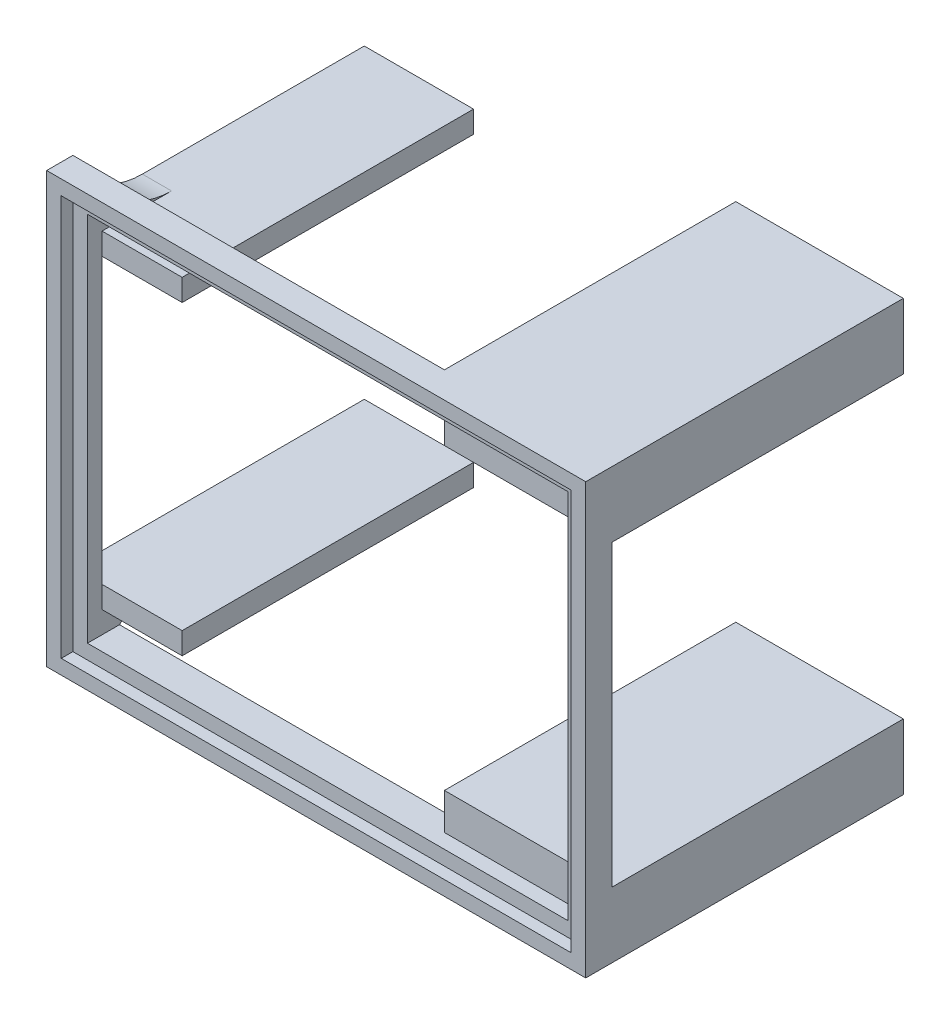
ISO-10303-21;
HEADER;
FILE_DESCRIPTION(('STEP AP214'),'2;1');
FILE_NAME('part.step','',(''),(''),'','','');
FILE_SCHEMA(('AUTOMOTIVE_DESIGN { 1 0 10303 214 1 1 1 1 }'));
ENDSEC;
DATA;
#1=APPLICATION_CONTEXT('core data for automotive mechanical design processes');
#2=APPLICATION_PROTOCOL_DEFINITION('international standard','automotive_design',2000,#1);
#3=PRODUCT_CONTEXT('',#1,'mechanical');
#4=PRODUCT('Part','Part','',(#3));
#5=PRODUCT_RELATED_PRODUCT_CATEGORY('part','',(#4));
#6=PRODUCT_DEFINITION_FORMATION('','',#4);
#7=PRODUCT_DEFINITION_CONTEXT('part definition',#1,'design');
#8=PRODUCT_DEFINITION('design','',#6,#7);
#9=PRODUCT_DEFINITION_SHAPE('','',#8);
#10=(LENGTH_UNIT() NAMED_UNIT(*) SI_UNIT(.MILLI.,.METRE.));
#11=(NAMED_UNIT(*) PLANE_ANGLE_UNIT() SI_UNIT($,.RADIAN.));
#12=(NAMED_UNIT(*) SI_UNIT($,.STERADIAN.) SOLID_ANGLE_UNIT());
#13=UNCERTAINTY_MEASURE_WITH_UNIT(LENGTH_MEASURE(1.E-05),#10,'distance_accuracy_value','');
#14=(GEOMETRIC_REPRESENTATION_CONTEXT(3) GLOBAL_UNCERTAINTY_ASSIGNED_CONTEXT((#13)) GLOBAL_UNIT_ASSIGNED_CONTEXT((#10,
#11,#12)) REPRESENTATION_CONTEXT('',''));
#15=CARTESIAN_POINT('',(0.,0.,0.));
#16=DIRECTION('',(0.,0.,1.));
#17=DIRECTION('',(1.,0.,0.));
#18=AXIS2_PLACEMENT_3D('',#15,#16,#17);
#19=CARTESIAN_POINT('',(0.,0.,0.));
#20=DIRECTION('',(0.,0.,-1.));
#21=DIRECTION('',(-1.,0.,0.));
#22=AXIS2_PLACEMENT_3D('',#19,#20,#21);
#23=PLANE('',#22);
#24=DIRECTION('',(0.,-1.,0.));
#25=VECTOR('',#24,1.);
#26=CARTESIAN_POINT('',(-33.,-25.5,0.));
#27=LINE('',#26,#25);
#28=CARTESIAN_POINT('',(-33.,19.5,0.));
#29=VERTEX_POINT('',#28);
#30=CARTESIAN_POINT('',(-33.,-19.5,0.));
#31=VERTEX_POINT('',#30);
#32=EDGE_CURVE('E471',#29,#31,#27,.T.);
#33=ORIENTED_EDGE('',*,*,#32,.T.);
#34=DIRECTION('',(1.,0.,0.));
#35=VECTOR('',#34,1.);
#36=CARTESIAN_POINT('',(-37.,-19.5,0.));
#37=LINE('',#36,#35);
#38=CARTESIAN_POINT('',(-37.,-19.5,0.));
#39=VERTEX_POINT('',#38);
#40=EDGE_CURVE('E643',#39,#31,#37,.T.);
#41=ORIENTED_EDGE('',*,*,#40,.F.);
#42=DIRECTION('',(0.,-1.,0.));
#43=VECTOR('',#42,1.);
#44=CARTESIAN_POINT('',(-37.,-29.5,0.));
#45=LINE('',#44,#43);
#46=CARTESIAN_POINT('',(-37.,19.5,0.));
#47=VERTEX_POINT('',#46);
#48=EDGE_CURVE('E446',#47,#39,#45,.T.);
#49=ORIENTED_EDGE('',*,*,#48,.F.);
#50=DIRECTION('',(-1.,0.,0.));
#51=VECTOR('',#50,1.);
#52=CARTESIAN_POINT('',(-37.,19.5,0.));
#53=LINE('',#52,#51);
#54=EDGE_CURVE('E305',#29,#47,#53,.T.);
#55=ORIENTED_EDGE('',*,*,#54,.F.);
#56=EDGE_LOOP('',(#33,#41,#49,#55));
#57=FACE_BOUND('',#56,.T.);
#58=ADVANCED_FACE('F39',(#57),#23,.T.);
#59=DIRECTION('',(0.,1.,0.));
#60=VECTOR('',#59,1.);
#61=CARTESIAN_POINT('',(37.,-29.5,0.));
#62=LINE('',#61,#60);
#63=CARTESIAN_POINT('',(37.,-20.5,0.));
#64=VERTEX_POINT('',#63);
#65=CARTESIAN_POINT('',(37.,20.5,0.));
#66=VERTEX_POINT('',#65);
#67=EDGE_CURVE('E432',#64,#66,#62,.T.);
#68=ORIENTED_EDGE('',*,*,#67,.F.);
#69=DIRECTION('',(1.,0.,0.));
#70=VECTOR('',#69,1.);
#71=CARTESIAN_POINT('',(37.,-20.5,0.));
#72=LINE('',#71,#70);
#73=CARTESIAN_POINT('',(33.,-20.5,0.));
#74=VERTEX_POINT('',#73);
#75=EDGE_CURVE('E345',#74,#64,#72,.T.);
#76=ORIENTED_EDGE('',*,*,#75,.F.);
#77=DIRECTION('',(0.,1.,0.));
#78=VECTOR('',#77,1.);
#79=CARTESIAN_POINT('',(33.,-25.5,0.));
#80=LINE('',#79,#78);
#81=CARTESIAN_POINT('',(33.,20.5,0.));
#82=VERTEX_POINT('',#81);
#83=EDGE_CURVE('E486',#74,#82,#80,.T.);
#84=ORIENTED_EDGE('',*,*,#83,.T.);
#85=DIRECTION('',(-1.,0.,0.));
#86=VECTOR('',#85,1.);
#87=CARTESIAN_POINT('',(37.,20.5,0.));
#88=LINE('',#87,#86);
#89=EDGE_CURVE('E379',#66,#82,#88,.T.);
#90=ORIENTED_EDGE('',*,*,#89,.F.);
#91=EDGE_LOOP('',(#68,#76,#84,#90));
#92=FACE_BOUND('',#91,.T.);
#93=ADVANCED_FACE('F684',(#92),#23,.T.);
#94=CARTESIAN_POINT('',(0.,0.,2.));
#95=DIRECTION('',(0.,0.,-1.));
#96=DIRECTION('',(-1.,0.,0.));
#97=AXIS2_PLACEMENT_3D('',#94,#95,#96);
#98=PLANE('',#97);
#99=DIRECTION('',(0.,1.,0.));
#100=VECTOR('',#99,1.);
#101=CARTESIAN_POINT('',(35.,-27.5,2.));
#102=LINE('',#101,#100);
#103=CARTESIAN_POINT('',(35.,-27.5,2.));
#104=VERTEX_POINT('',#103);
#105=CARTESIAN_POINT('',(35.,27.5,2.));
#106=VERTEX_POINT('',#105);
#107=EDGE_CURVE('E505',#104,#106,#102,.T.);
#108=ORIENTED_EDGE('',*,*,#107,.T.);
#109=DIRECTION('',(-1.,0.,0.));
#110=VECTOR('',#109,1.);
#111=CARTESIAN_POINT('',(-35.,27.5,2.));
#112=LINE('',#111,#110);
#113=CARTESIAN_POINT('',(-35.,27.5,2.));
#114=VERTEX_POINT('',#113);
#115=EDGE_CURVE('E509',#106,#114,#112,.T.);
#116=ORIENTED_EDGE('',*,*,#115,.T.);
#117=DIRECTION('',(0.,-1.,0.));
#118=VECTOR('',#117,1.);
#119=CARTESIAN_POINT('',(-35.,-27.5,2.));
#120=LINE('',#119,#118);
#121=CARTESIAN_POINT('',(-35.,-27.5,2.));
#122=VERTEX_POINT('',#121);
#123=EDGE_CURVE('E513',#114,#122,#120,.T.);
#124=ORIENTED_EDGE('',*,*,#123,.T.);
#125=DIRECTION('',(1.,0.,0.));
#126=VECTOR('',#125,1.);
#127=CARTESIAN_POINT('',(-35.,-27.5,2.));
#128=LINE('',#127,#126);
#129=EDGE_CURVE('E517',#122,#104,#128,.T.);
#130=ORIENTED_EDGE('',*,*,#129,.T.);
#131=EDGE_LOOP('',(#108,#116,#124,#130));
#132=FACE_BOUND('',#131,.T.);
#133=DIRECTION('',(0.,1.,0.));
#134=VECTOR('',#133,1.);
#135=CARTESIAN_POINT('',(33.,-25.5,2.));
#136=LINE('',#135,#134);
#137=CARTESIAN_POINT('',(33.,-25.5,2.));
#138=VERTEX_POINT('',#137);
#139=CARTESIAN_POINT('',(33.,25.5,2.));
#140=VERTEX_POINT('',#139);
#141=EDGE_CURVE('E467',#138,#140,#136,.T.);
#142=ORIENTED_EDGE('',*,*,#141,.F.);
#143=DIRECTION('',(1.,0.,0.));
#144=VECTOR('',#143,1.);
#145=CARTESIAN_POINT('',(-33.,-25.5,2.));
#146=LINE('',#145,#144);
#147=CARTESIAN_POINT('',(-33.,-25.5,2.));
#148=VERTEX_POINT('',#147);
#149=EDGE_CURVE('E478',#148,#138,#146,.T.);
#150=ORIENTED_EDGE('',*,*,#149,.F.);
#151=DIRECTION('',(0.,-1.,0.));
#152=VECTOR('',#151,1.);
#153=CARTESIAN_POINT('',(-33.,-25.5,2.));
#154=LINE('',#153,#152);
#155=CARTESIAN_POINT('',(-33.,25.5,2.));
#156=VERTEX_POINT('',#155);
#157=EDGE_CURVE('E474',#156,#148,#154,.T.);
#158=ORIENTED_EDGE('',*,*,#157,.F.);
#159=DIRECTION('',(-1.,0.,0.));
#160=VECTOR('',#159,1.);
#161=CARTESIAN_POINT('',(-33.,25.5,2.));
#162=LINE('',#161,#160);
#163=EDGE_CURVE('E470',#140,#156,#162,.T.);
#164=ORIENTED_EDGE('',*,*,#163,.F.);
#165=EDGE_LOOP('',(#142,#150,#158,#164));
#166=FACE_BOUND('',#165,.T.);
#167=ADVANCED_FACE('F617',(#132,#166),#98,.F.);
#168=CARTESIAN_POINT('',(33.,-25.5,2.));
#169=DIRECTION('',(-1.,0.,0.));
#170=DIRECTION('',(0.,0.,1.));
#171=AXIS2_PLACEMENT_3D('',#168,#169,#170);
#172=PLANE('',#171);
#173=CARTESIAN_POINT('',(33.,-25.5,0.));
#174=VERTEX_POINT('',#173);
#175=EDGE_CURVE('E482',#174,#74,#80,.T.);
#176=ORIENTED_EDGE('',*,*,#175,.F.);
#177=DIRECTION('',(0.,0.,-1.));
#178=VECTOR('',#177,1.);
#179=CARTESIAN_POINT('',(33.,-25.5,2.));
#180=LINE('',#179,#178);
#181=EDGE_CURVE('E481',#138,#174,#180,.T.);
#182=ORIENTED_EDGE('',*,*,#181,.F.);
#183=ORIENTED_EDGE('',*,*,#141,.T.);
#184=DIRECTION('',(0.,0.,-1.));
#185=VECTOR('',#184,1.);
#186=CARTESIAN_POINT('',(33.,25.5,2.));
#187=LINE('',#186,#185);
#188=CARTESIAN_POINT('',(33.,25.5,0.));
#189=VERTEX_POINT('',#188);
#190=EDGE_CURVE('E501',#140,#189,#187,.T.);
#191=ORIENTED_EDGE('',*,*,#190,.T.);
#192=EDGE_CURVE('E458',#82,#189,#80,.T.);
#193=ORIENTED_EDGE('',*,*,#192,.F.);
#194=ORIENTED_EDGE('',*,*,#83,.F.);
#195=EDGE_LOOP('',(#176,#182,#183,#191,#193,#194));
#196=FACE_BOUND('',#195,.T.);
#197=ADVANCED_FACE('F611',(#196),#172,.T.);
#198=CARTESIAN_POINT('',(-33.,25.5,2.));
#199=DIRECTION('',(0.,-1.,0.));
#200=DIRECTION('',(0.,0.,-1.));
#201=AXIS2_PLACEMENT_3D('',#198,#199,#200);
#202=PLANE('',#201);
#203=DIRECTION('',(-1.,0.,0.));
#204=VECTOR('',#203,1.);
#205=CARTESIAN_POINT('',(-33.,25.5,0.));
#206=LINE('',#205,#204);
#207=CARTESIAN_POINT('',(14.,25.5,0.));
#208=VERTEX_POINT('',#207);
#209=EDGE_CURVE('E485',#189,#208,#206,.T.);
#210=ORIENTED_EDGE('',*,*,#209,.F.);
#211=ORIENTED_EDGE('',*,*,#190,.F.);
#212=ORIENTED_EDGE('',*,*,#163,.T.);
#213=DIRECTION('',(0.,0.,-1.));
#214=VECTOR('',#213,1.);
#215=CARTESIAN_POINT('',(-33.,25.5,2.));
#216=LINE('',#215,#214);
#217=CARTESIAN_POINT('',(-33.,25.5,-2.3979635856266));
#218=VERTEX_POINT('',#217);
#219=EDGE_CURVE('E61',#156,#218,#216,.T.);
#220=ORIENTED_EDGE('',*,*,#219,.T.);
#221=DIRECTION('',(1.,0.,0.));
#222=VECTOR('',#221,1.);
#223=CARTESIAN_POINT('',(-33.,25.5,-2.3979635856266));
#224=LINE('',#223,#222);
#225=CARTESIAN_POINT('',(14.,25.5,-2.3979635856266));
#226=VERTEX_POINT('',#225);
#227=EDGE_CURVE('E48',#218,#226,#224,.T.);
#228=ORIENTED_EDGE('',*,*,#227,.T.);
#229=DIRECTION('',(0.,0.,-1.));
#230=VECTOR('',#229,1.);
#231=CARTESIAN_POINT('',(14.,25.5,-40.));
#232=LINE('',#231,#230);
#233=EDGE_CURVE('E55',#208,#226,#232,.T.);
#234=ORIENTED_EDGE('',*,*,#233,.F.);
#235=EDGE_LOOP('',(#210,#211,#212,#220,#228,#234));
#236=FACE_BOUND('',#235,.T.);
#237=ADVANCED_FACE('F562',(#236),#202,.T.);
#238=CARTESIAN_POINT('',(-33.,-25.5,2.));
#239=DIRECTION('',(1.,0.,0.));
#240=DIRECTION('',(0.,0.,-1.));
#241=AXIS2_PLACEMENT_3D('',#238,#239,#240);
#242=PLANE('',#241);
#243=DIRECTION('',(0.,1.,0.));
#244=VECTOR('',#243,1.);
#245=CARTESIAN_POINT('',(-33.,-25.5,0.));
#246=LINE('',#245,#244);
#247=CARTESIAN_POINT('',(-33.,22.5,0.));
#248=VERTEX_POINT('',#247);
#249=EDGE_CURVE('E323',#29,#248,#246,.T.);
#250=ORIENTED_EDGE('',*,*,#249,.T.);
#251=DIRECTION('',(0.,0.,1.));
#252=VECTOR('',#251,1.);
#253=CARTESIAN_POINT('',(-33.,22.5,-40.));
#254=LINE('',#253,#252);
#255=CARTESIAN_POINT('',(-33.,22.5,-9.53939201416946));
#256=VERTEX_POINT('',#255);
#257=EDGE_CURVE('E536',#256,#248,#254,.T.);
#258=ORIENTED_EDGE('',*,*,#257,.F.);
#259=CARTESIAN_POINT('',(-33.,32.5,-9.53939201416946));
#260=DIRECTION('',(1.,0.,0.));
#261=DIRECTION('',(0.,0.,-1.));
#262=AXIS2_PLACEMENT_3D('',#259,#260,#261);
#263=CIRCLE('',#262,10.);
#264=EDGE_CURVE('E558',#256,#218,#263,.F.);
#265=ORIENTED_EDGE('',*,*,#264,.T.);
#266=ORIENTED_EDGE('',*,*,#219,.F.);
#267=ORIENTED_EDGE('',*,*,#157,.T.);
#268=DIRECTION('',(0.,0.,-1.));
#269=VECTOR('',#268,1.);
#270=CARTESIAN_POINT('',(-33.,-25.5,2.));
#271=LINE('',#270,#269);
#272=CARTESIAN_POINT('',(-33.,-25.5,-2.3979635856266));
#273=VERTEX_POINT('',#272);
#274=EDGE_CURVE('E496',#148,#273,#271,.T.);
#275=ORIENTED_EDGE('',*,*,#274,.T.);
#276=CARTESIAN_POINT('',(-33.,-32.5,-9.53939201416946));
#277=DIRECTION('',(1.,0.,0.));
#278=DIRECTION('',(0.,0.,-1.));
#279=AXIS2_PLACEMENT_3D('',#276,#277,#278);
#280=CIRCLE('',#279,10.);
#281=CARTESIAN_POINT('',(-33.,-22.5,-9.53939201416946));
#282=VERTEX_POINT('',#281);
#283=EDGE_CURVE('E555',#273,#282,#280,.F.);
#284=ORIENTED_EDGE('',*,*,#283,.T.);
#285=DIRECTION('',(0.,0.,-1.));
#286=VECTOR('',#285,1.);
#287=CARTESIAN_POINT('',(-33.,-22.5,-40.));
#288=LINE('',#287,#286);
#289=CARTESIAN_POINT('',(-33.,-22.5,0.));
#290=VERTEX_POINT('',#289);
#291=EDGE_CURVE('E521',#290,#282,#288,.T.);
#292=ORIENTED_EDGE('',*,*,#291,.F.);
#293=DIRECTION('',(0.,1.,0.));
#294=VECTOR('',#293,1.);
#295=CARTESIAN_POINT('',(-33.,-25.5,0.));
#296=LINE('',#295,#294);
#297=EDGE_CURVE('E274',#290,#31,#296,.T.);
#298=ORIENTED_EDGE('',*,*,#297,.T.);
#299=ORIENTED_EDGE('',*,*,#32,.F.);
#300=EDGE_LOOP('',(#250,#258,#265,#266,#267,#275,#284,#292,#298,#299));
#301=FACE_BOUND('',#300,.T.);
#302=ADVANCED_FACE('F620',(#301),#242,.T.);
#303=CARTESIAN_POINT('',(-33.,-25.5,2.));
#304=DIRECTION('',(0.,1.,0.));
#305=DIRECTION('',(0.,0.,1.));
#306=AXIS2_PLACEMENT_3D('',#303,#304,#305);
#307=PLANE('',#306);
#308=DIRECTION('',(1.,0.,0.));
#309=VECTOR('',#308,1.);
#310=CARTESIAN_POINT('',(-33.,-25.5,0.));
#311=LINE('',#310,#309);
#312=CARTESIAN_POINT('',(14.,-25.5,0.));
#313=VERTEX_POINT('',#312);
#314=EDGE_CURVE('E359',#313,#174,#311,.T.);
#315=ORIENTED_EDGE('',*,*,#314,.F.);
#316=DIRECTION('',(0.,0.,1.));
#317=VECTOR('',#316,1.);
#318=CARTESIAN_POINT('',(14.,-25.5,-40.));
#319=LINE('',#318,#317);
#320=CARTESIAN_POINT('',(14.,-25.5,-2.3979635856266));
#321=VERTEX_POINT('',#320);
#322=EDGE_CURVE('E533',#321,#313,#319,.T.);
#323=ORIENTED_EDGE('',*,*,#322,.F.);
#324=DIRECTION('',(-1.,0.,0.));
#325=VECTOR('',#324,1.);
#326=CARTESIAN_POINT('',(14.,-25.5,-2.3979635856266));
#327=LINE('',#326,#325);
#328=EDGE_CURVE('E551',#321,#273,#327,.T.);
#329=ORIENTED_EDGE('',*,*,#328,.T.);
#330=ORIENTED_EDGE('',*,*,#274,.F.);
#331=ORIENTED_EDGE('',*,*,#149,.T.);
#332=ORIENTED_EDGE('',*,*,#181,.T.);
#333=EDGE_LOOP('',(#315,#323,#329,#330,#331,#332));
#334=FACE_BOUND('',#333,.T.);
#335=ADVANCED_FACE('F827',(#334),#307,.T.);
#336=CARTESIAN_POINT('',(35.,27.5,0.));
#337=DIRECTION('',(0.,1.,0.));
#338=DIRECTION('',(0.,0.,1.));
#339=AXIS2_PLACEMENT_3D('',#336,#337,#338);
#340=PLANE('',#339);
#341=DIRECTION('',(0.,0.,1.));
#342=VECTOR('',#341,1.);
#343=CARTESIAN_POINT('',(-35.,27.5,0.));
#344=LINE('',#343,#342);
#345=CARTESIAN_POINT('',(-35.,27.5,3.6));
#346=VERTEX_POINT('',#345);
#347=EDGE_CURVE('E428',#114,#346,#344,.T.);
#348=ORIENTED_EDGE('',*,*,#347,.F.);
#349=ORIENTED_EDGE('',*,*,#115,.F.);
#350=DIRECTION('',(0.,0.,1.));
#351=VECTOR('',#350,1.);
#352=CARTESIAN_POINT('',(35.,27.5,0.));
#353=LINE('',#352,#351);
#354=CARTESIAN_POINT('',(35.,27.5,3.6));
#355=VERTEX_POINT('',#354);
#356=EDGE_CURVE('E429',#106,#355,#353,.T.);
#357=ORIENTED_EDGE('',*,*,#356,.T.);
#358=DIRECTION('',(-1.,0.,0.));
#359=VECTOR('',#358,1.);
#360=CARTESIAN_POINT('',(35.,27.5,3.6));
#361=LINE('',#360,#359);
#362=EDGE_CURVE('E396',#355,#346,#361,.T.);
#363=ORIENTED_EDGE('',*,*,#362,.T.);
#364=EDGE_LOOP('',(#348,#349,#357,#363));
#365=FACE_BOUND('',#364,.T.);
#366=ADVANCED_FACE('F836',(#365),#340,.F.);
#367=CARTESIAN_POINT('',(-35.,-27.5,0.));
#368=DIRECTION('',(0.,-1.,0.));
#369=DIRECTION('',(0.,0.,-1.));
#370=AXIS2_PLACEMENT_3D('',#367,#368,#369);
#371=PLANE('',#370);
#372=DIRECTION('',(0.,0.,1.));
#373=VECTOR('',#372,1.);
#374=CARTESIAN_POINT('',(35.,-27.5,0.));
#375=LINE('',#374,#373);
#376=CARTESIAN_POINT('',(35.,-27.5,3.6));
#377=VERTEX_POINT('',#376);
#378=EDGE_CURVE('E433',#104,#377,#375,.T.);
#379=ORIENTED_EDGE('',*,*,#378,.F.);
#380=ORIENTED_EDGE('',*,*,#129,.F.);
#381=DIRECTION('',(0.,0.,1.));
#382=VECTOR('',#381,1.);
#383=CARTESIAN_POINT('',(-35.,-27.5,0.));
#384=LINE('',#383,#382);
#385=CARTESIAN_POINT('',(-35.,-27.5,3.6));
#386=VERTEX_POINT('',#385);
#387=EDGE_CURVE('E436',#122,#386,#384,.T.);
#388=ORIENTED_EDGE('',*,*,#387,.T.);
#389=DIRECTION('',(1.,0.,0.));
#390=VECTOR('',#389,1.);
#391=CARTESIAN_POINT('',(-35.,-27.5,3.6));
#392=LINE('',#391,#390);
#393=EDGE_CURVE('E404',#386,#377,#392,.T.);
#394=ORIENTED_EDGE('',*,*,#393,.T.);
#395=EDGE_LOOP('',(#379,#380,#388,#394));
#396=FACE_BOUND('',#395,.T.);
#397=ADVANCED_FACE('F962',(#396),#371,.F.);
#398=CARTESIAN_POINT('',(35.,-27.5,0.));
#399=DIRECTION('',(1.,0.,0.));
#400=DIRECTION('',(0.,0.,-1.));
#401=AXIS2_PLACEMENT_3D('',#398,#399,#400);
#402=PLANE('',#401);
#403=ORIENTED_EDGE('',*,*,#356,.F.);
#404=ORIENTED_EDGE('',*,*,#107,.F.);
#405=ORIENTED_EDGE('',*,*,#378,.T.);
#406=DIRECTION('',(0.,1.,0.));
#407=VECTOR('',#406,1.);
#408=CARTESIAN_POINT('',(35.,-27.5,3.6));
#409=LINE('',#408,#407);
#410=EDGE_CURVE('E408',#377,#355,#409,.T.);
#411=ORIENTED_EDGE('',*,*,#410,.T.);
#412=EDGE_LOOP('',(#403,#404,#405,#411));
#413=FACE_BOUND('',#412,.T.);
#414=ADVANCED_FACE('F951',(#413),#402,.F.);
#415=CARTESIAN_POINT('',(-35.,27.5,0.));
#416=DIRECTION('',(-1.,0.,0.));
#417=DIRECTION('',(0.,0.,1.));
#418=AXIS2_PLACEMENT_3D('',#415,#416,#417);
#419=PLANE('',#418);
#420=ORIENTED_EDGE('',*,*,#387,.F.);
#421=ORIENTED_EDGE('',*,*,#123,.F.);
#422=ORIENTED_EDGE('',*,*,#347,.T.);
#423=DIRECTION('',(0.,-1.,0.));
#424=VECTOR('',#423,1.);
#425=CARTESIAN_POINT('',(-35.,27.5,3.6));
#426=LINE('',#425,#424);
#427=EDGE_CURVE('E400',#346,#386,#426,.T.);
#428=ORIENTED_EDGE('',*,*,#427,.T.);
#429=EDGE_LOOP('',(#420,#421,#422,#428));
#430=FACE_BOUND('',#429,.T.);
#431=ADVANCED_FACE('F916',(#430),#419,.F.);
#432=CARTESIAN_POINT('',(37.,-29.5,0.));
#433=DIRECTION('',(1.,0.,0.));
#434=DIRECTION('',(0.,0.,-1.));
#435=AXIS2_PLACEMENT_3D('',#432,#433,#434);
#436=PLANE('',#435);
#437=DIRECTION('',(0.,0.,1.));
#438=VECTOR('',#437,1.);
#439=CARTESIAN_POINT('',(37.,29.5,0.));
#440=LINE('',#439,#438);
#441=CARTESIAN_POINT('',(37.,29.5,-40.));
#442=VERTEX_POINT('',#441);
#443=CARTESIAN_POINT('',(37.,29.5,3.6));
#444=VERTEX_POINT('',#443);
#445=EDGE_CURVE('E454',#442,#444,#440,.T.);
#446=ORIENTED_EDGE('',*,*,#445,.T.);
#447=DIRECTION('',(0.,1.,0.));
#448=VECTOR('',#447,1.);
#449=CARTESIAN_POINT('',(37.,-29.5,3.6));
#450=LINE('',#449,#448);
#451=CARTESIAN_POINT('',(37.,-29.5,3.6));
#452=VERTEX_POINT('',#451);
#453=EDGE_CURVE('E412',#452,#444,#450,.T.);
#454=ORIENTED_EDGE('',*,*,#453,.F.);
#455=DIRECTION('',(0.,0.,1.));
#456=VECTOR('',#455,1.);
#457=CARTESIAN_POINT('',(37.,-29.5,0.));
#458=LINE('',#457,#456);
#459=CARTESIAN_POINT('',(37.,-29.5,-40.));
#460=VERTEX_POINT('',#459);
#461=EDGE_CURVE('E455',#460,#452,#458,.T.);
#462=ORIENTED_EDGE('',*,*,#461,.F.);
#463=DIRECTION('',(0.,-1.,0.));
#464=VECTOR('',#463,1.);
#465=CARTESIAN_POINT('',(37.,-29.5,-40.));
#466=LINE('',#465,#464);
#467=CARTESIAN_POINT('',(37.,-20.5,-40.));
#468=VERTEX_POINT('',#467);
#469=EDGE_CURVE('E328',#468,#460,#466,.T.);
#470=ORIENTED_EDGE('',*,*,#469,.F.);
#471=DIRECTION('',(0.,0.,1.));
#472=VECTOR('',#471,1.);
#473=CARTESIAN_POINT('',(37.,-20.5,-40.));
#474=LINE('',#473,#472);
#475=EDGE_CURVE('E342',#468,#64,#474,.T.);
#476=ORIENTED_EDGE('',*,*,#475,.T.);
#477=ORIENTED_EDGE('',*,*,#67,.T.);
#478=DIRECTION('',(0.,0.,1.));
#479=VECTOR('',#478,1.);
#480=CARTESIAN_POINT('',(37.,20.5,-40.));
#481=LINE('',#480,#479);
#482=CARTESIAN_POINT('',(37.,20.5,-40.));
#483=VERTEX_POINT('',#482);
#484=EDGE_CURVE('E392',#483,#66,#481,.T.);
#485=ORIENTED_EDGE('',*,*,#484,.F.);
#486=DIRECTION('',(0.,-1.,0.));
#487=VECTOR('',#486,1.);
#488=CARTESIAN_POINT('',(37.,29.5,-40.));
#489=LINE('',#488,#487);
#490=EDGE_CURVE('E363',#442,#483,#489,.T.);
#491=ORIENTED_EDGE('',*,*,#490,.F.);
#492=EDGE_LOOP('',(#446,#454,#462,#470,#476,#477,#485,#491));
#493=FACE_BOUND('',#492,.T.);
#494=ADVANCED_FACE('F594',(#493),#436,.T.);
#495=CARTESIAN_POINT('',(-37.,-29.5,0.));
#496=DIRECTION('',(0.,-1.,0.));
#497=DIRECTION('',(0.,0.,-1.));
#498=AXIS2_PLACEMENT_3D('',#495,#496,#497);
#499=PLANE('',#498);
#500=ORIENTED_EDGE('',*,*,#461,.T.);
#501=DIRECTION('',(1.,0.,0.));
#502=VECTOR('',#501,1.);
#503=CARTESIAN_POINT('',(-37.,-29.5,3.6));
#504=LINE('',#503,#502);
#505=CARTESIAN_POINT('',(-37.,-29.5,3.6));
#506=VERTEX_POINT('',#505);
#507=EDGE_CURVE('E424',#506,#452,#504,.T.);
#508=ORIENTED_EDGE('',*,*,#507,.F.);
#509=DIRECTION('',(0.,0.,1.));
#510=VECTOR('',#509,1.);
#511=CARTESIAN_POINT('',(-37.,-29.5,0.));
#512=LINE('',#511,#510);
#513=CARTESIAN_POINT('',(-37.,-29.5,0.));
#514=VERTEX_POINT('',#513);
#515=EDGE_CURVE('E459',#514,#506,#512,.T.);
#516=ORIENTED_EDGE('',*,*,#515,.F.);
#517=DIRECTION('',(1.,0.,0.));
#518=VECTOR('',#517,1.);
#519=CARTESIAN_POINT('',(-37.,-29.5,0.));
#520=LINE('',#519,#518);
#521=CARTESIAN_POINT('',(14.,-29.5,0.));
#522=VERTEX_POINT('',#521);
#523=EDGE_CURVE('E450',#514,#522,#520,.T.);
#524=ORIENTED_EDGE('',*,*,#523,.T.);
#525=DIRECTION('',(0.,0.,1.));
#526=VECTOR('',#525,1.);
#527=CARTESIAN_POINT('',(14.,-29.5,-40.));
#528=LINE('',#527,#526);
#529=CARTESIAN_POINT('',(14.,-29.5,-40.));
#530=VERTEX_POINT('',#529);
#531=EDGE_CURVE('E356',#530,#522,#528,.T.);
#532=ORIENTED_EDGE('',*,*,#531,.F.);
#533=DIRECTION('',(-1.,0.,0.));
#534=VECTOR('',#533,1.);
#535=CARTESIAN_POINT('',(37.,-29.5,-40.));
#536=LINE('',#535,#534);
#537=EDGE_CURVE('E332',#460,#530,#536,.T.);
#538=ORIENTED_EDGE('',*,*,#537,.F.);
#539=EDGE_LOOP('',(#500,#508,#516,#524,#532,#538));
#540=FACE_BOUND('',#539,.T.);
#541=ADVANCED_FACE('F588',(#540),#499,.T.);
#542=CARTESIAN_POINT('',(-37.,-29.5,0.));
#543=DIRECTION('',(-1.,0.,0.));
#544=DIRECTION('',(0.,0.,1.));
#545=AXIS2_PLACEMENT_3D('',#542,#543,#544);
#546=PLANE('',#545);
#547=ORIENTED_EDGE('',*,*,#515,.T.);
#548=DIRECTION('',(0.,-1.,0.));
#549=VECTOR('',#548,1.);
#550=CARTESIAN_POINT('',(-37.,-29.5,3.6));
#551=LINE('',#550,#549);
#552=CARTESIAN_POINT('',(-37.,29.5,3.6));
#553=VERTEX_POINT('',#552);
#554=EDGE_CURVE('E420',#553,#506,#551,.T.);
#555=ORIENTED_EDGE('',*,*,#554,.F.);
#556=DIRECTION('',(0.,0.,1.));
#557=VECTOR('',#556,1.);
#558=CARTESIAN_POINT('',(-37.,29.5,0.));
#559=LINE('',#558,#557);
#560=CARTESIAN_POINT('',(-37.,29.5,0.));
#561=VERTEX_POINT('',#560);
#562=EDGE_CURVE('E462',#561,#553,#559,.T.);
#563=ORIENTED_EDGE('',*,*,#562,.F.);
#564=CARTESIAN_POINT('',(-37.,32.5,-9.53939201416946));
#565=DIRECTION('',(-1.,0.,0.));
#566=DIRECTION('',(0.,0.,1.));
#567=AXIS2_PLACEMENT_3D('',#564,#565,#566);
#568=CIRCLE('',#567,10.);
#569=CARTESIAN_POINT('',(-37.,22.5,-9.53939201416946));
#570=VERTEX_POINT('',#569);
#571=EDGE_CURVE('E11',#561,#570,#568,.F.);
#572=ORIENTED_EDGE('',*,*,#571,.T.);
#573=DIRECTION('',(0.,0.,1.));
#574=VECTOR('',#573,1.);
#575=CARTESIAN_POINT('',(-37.,22.5,-40.));
#576=LINE('',#575,#574);
#577=CARTESIAN_POINT('',(-37.,22.5,-40.));
#578=VERTEX_POINT('',#577);
#579=EDGE_CURVE('E319',#578,#570,#576,.T.);
#580=ORIENTED_EDGE('',*,*,#579,.F.);
#581=DIRECTION('',(0.,1.,0.));
#582=VECTOR('',#581,1.);
#583=CARTESIAN_POINT('',(-37.,19.5,-40.));
#584=LINE('',#583,#582);
#585=CARTESIAN_POINT('',(-37.,19.5,-40.));
#586=VERTEX_POINT('',#585);
#587=EDGE_CURVE('E285',#586,#578,#584,.T.);
#588=ORIENTED_EDGE('',*,*,#587,.F.);
#589=DIRECTION('',(0.,0.,1.));
#590=VECTOR('',#589,1.);
#591=CARTESIAN_POINT('',(-37.,19.5,-40.));
#592=LINE('',#591,#590);
#593=EDGE_CURVE('E299',#586,#47,#592,.T.);
#594=ORIENTED_EDGE('',*,*,#593,.T.);
#595=ORIENTED_EDGE('',*,*,#48,.T.);
#596=DIRECTION('',(0.,0.,1.));
#597=VECTOR('',#596,1.);
#598=CARTESIAN_POINT('',(-37.,-19.5,-40.));
#599=LINE('',#598,#597);
#600=CARTESIAN_POINT('',(-37.,-19.5,-40.));
#601=VERTEX_POINT('',#600);
#602=EDGE_CURVE('E644',#601,#39,#599,.T.);
#603=ORIENTED_EDGE('',*,*,#602,.F.);
#604=DIRECTION('',(0.,1.,0.));
#605=VECTOR('',#604,1.);
#606=CARTESIAN_POINT('',(-37.,-19.5,-40.));
#607=LINE('',#606,#605);
#608=CARTESIAN_POINT('',(-37.,-22.5,-40.));
#609=VERTEX_POINT('',#608);
#610=EDGE_CURVE('E263',#609,#601,#607,.T.);
#611=ORIENTED_EDGE('',*,*,#610,.F.);
#612=DIRECTION('',(0.,0.,1.));
#613=VECTOR('',#612,1.);
#614=CARTESIAN_POINT('',(-37.,-22.5,-40.));
#615=LINE('',#614,#613);
#616=CARTESIAN_POINT('',(-37.,-22.5,-9.53939201416946));
#617=VERTEX_POINT('',#616);
#618=EDGE_CURVE('E281',#609,#617,#615,.T.);
#619=ORIENTED_EDGE('',*,*,#618,.T.);
#620=CARTESIAN_POINT('',(-37.,-32.5,-9.53939201416946));
#621=DIRECTION('',(-1.,0.,0.));
#622=DIRECTION('',(0.,0.,1.));
#623=AXIS2_PLACEMENT_3D('',#620,#621,#622);
#624=CIRCLE('',#623,10.);
#625=EDGE_CURVE('E548',#617,#514,#624,.F.);
#626=ORIENTED_EDGE('',*,*,#625,.T.);
#627=EDGE_LOOP('',(#547,#555,#563,#572,#580,#588,#594,#595,#603,#611,#619,#626));
#628=FACE_BOUND('',#627,.T.);
#629=ADVANCED_FACE('F579',(#628),#546,.T.);
#630=CARTESIAN_POINT('',(-37.,29.5,0.));
#631=DIRECTION('',(0.,1.,0.));
#632=DIRECTION('',(0.,0.,1.));
#633=AXIS2_PLACEMENT_3D('',#630,#631,#632);
#634=PLANE('',#633);
#635=ORIENTED_EDGE('',*,*,#562,.T.);
#636=DIRECTION('',(-1.,0.,0.));
#637=VECTOR('',#636,1.);
#638=CARTESIAN_POINT('',(-37.,29.5,3.6));
#639=LINE('',#638,#637);
#640=EDGE_CURVE('E416',#444,#553,#639,.T.);
#641=ORIENTED_EDGE('',*,*,#640,.F.);
#642=ORIENTED_EDGE('',*,*,#445,.F.);
#643=DIRECTION('',(1.,0.,0.));
#644=VECTOR('',#643,1.);
#645=CARTESIAN_POINT('',(37.,29.5,-40.));
#646=LINE('',#645,#644);
#647=CARTESIAN_POINT('',(14.,29.5,-40.));
#648=VERTEX_POINT('',#647);
#649=EDGE_CURVE('E374',#648,#442,#646,.T.);
#650=ORIENTED_EDGE('',*,*,#649,.F.);
#651=DIRECTION('',(0.,0.,1.));
#652=VECTOR('',#651,1.);
#653=CARTESIAN_POINT('',(14.,29.5,-40.));
#654=LINE('',#653,#652);
#655=CARTESIAN_POINT('',(14.,29.5,0.));
#656=VERTEX_POINT('',#655);
#657=EDGE_CURVE('E378',#648,#656,#654,.T.);
#658=ORIENTED_EDGE('',*,*,#657,.T.);
#659=DIRECTION('',(-1.,0.,0.));
#660=VECTOR('',#659,1.);
#661=CARTESIAN_POINT('',(-37.,29.5,0.));
#662=LINE('',#661,#660);
#663=EDGE_CURVE('E443',#656,#561,#662,.T.);
#664=ORIENTED_EDGE('',*,*,#663,.T.);
#665=EDGE_LOOP('',(#635,#641,#642,#650,#658,#664));
#666=FACE_BOUND('',#665,.T.);
#667=ADVANCED_FACE('F574',(#666),#634,.T.);
#668=CARTESIAN_POINT('',(0.,0.,3.6));
#669=DIRECTION('',(0.,0.,-1.));
#670=DIRECTION('',(-1.,0.,0.));
#671=AXIS2_PLACEMENT_3D('',#668,#669,#670);
#672=PLANE('',#671);
#673=ORIENTED_EDGE('',*,*,#453,.T.);
#674=ORIENTED_EDGE('',*,*,#640,.T.);
#675=ORIENTED_EDGE('',*,*,#554,.T.);
#676=ORIENTED_EDGE('',*,*,#507,.T.);
#677=EDGE_LOOP('',(#673,#674,#675,#676));
#678=FACE_BOUND('',#677,.T.);
#679=ORIENTED_EDGE('',*,*,#362,.F.);
#680=ORIENTED_EDGE('',*,*,#410,.F.);
#681=ORIENTED_EDGE('',*,*,#393,.F.);
#682=ORIENTED_EDGE('',*,*,#427,.F.);
#683=EDGE_LOOP('',(#679,#680,#681,#682));
#684=FACE_BOUND('',#683,.T.);
#685=ADVANCED_FACE('F584',(#678,#684),#672,.F.);
#686=CARTESIAN_POINT('',(0.,0.,0.));
#687=DIRECTION('',(0.,0.,-1.));
#688=DIRECTION('',(-1.,0.,0.));
#689=AXIS2_PLACEMENT_3D('',#686,#687,#688);
#690=PLANE('',#689);
#691=CARTESIAN_POINT('',(14.,20.5,0.));
#692=VERTEX_POINT('',#691);
#693=EDGE_CURVE('E362',#82,#692,#88,.T.);
#694=ORIENTED_EDGE('',*,*,#693,.F.);
#695=ORIENTED_EDGE('',*,*,#192,.T.);
#696=ORIENTED_EDGE('',*,*,#209,.T.);
#697=DIRECTION('',(0.,1.,0.));
#698=VECTOR('',#697,1.);
#699=CARTESIAN_POINT('',(14.,29.5,0.));
#700=LINE('',#699,#698);
#701=EDGE_CURVE('E368',#692,#208,#700,.T.);
#702=ORIENTED_EDGE('',*,*,#701,.F.);
#703=EDGE_LOOP('',(#694,#695,#696,#702));
#704=FACE_BOUND('',#703,.T.);
#705=ADVANCED_FACE('F604',(#704),#690,.F.);
#706=CARTESIAN_POINT('',(37.,20.5,-40.));
#707=DIRECTION('',(0.,1.,0.));
#708=DIRECTION('',(0.,0.,1.));
#709=AXIS2_PLACEMENT_3D('',#706,#707,#708);
#710=PLANE('',#709);
#711=ORIENTED_EDGE('',*,*,#89,.T.);
#712=ORIENTED_EDGE('',*,*,#693,.T.);
#713=DIRECTION('',(0.,0.,1.));
#714=VECTOR('',#713,1.);
#715=CARTESIAN_POINT('',(14.,20.5,-40.));
#716=LINE('',#715,#714);
#717=CARTESIAN_POINT('',(14.,20.5,-40.));
#718=VERTEX_POINT('',#717);
#719=EDGE_CURVE('E388',#718,#692,#716,.T.);
#720=ORIENTED_EDGE('',*,*,#719,.F.);
#721=DIRECTION('',(-1.,0.,0.));
#722=VECTOR('',#721,1.);
#723=CARTESIAN_POINT('',(37.,20.5,-40.));
#724=LINE('',#723,#722);
#725=EDGE_CURVE('E367',#483,#718,#724,.T.);
#726=ORIENTED_EDGE('',*,*,#725,.F.);
#727=ORIENTED_EDGE('',*,*,#484,.T.);
#728=EDGE_LOOP('',(#711,#712,#720,#726,#727));
#729=FACE_BOUND('',#728,.T.);
#730=ADVANCED_FACE('F685',(#729),#710,.F.);
#731=CARTESIAN_POINT('',(14.,29.5,-40.));
#732=DIRECTION('',(1.,0.,0.));
#733=DIRECTION('',(0.,0.,-1.));
#734=AXIS2_PLACEMENT_3D('',#731,#732,#733);
#735=PLANE('',#734);
#736=ORIENTED_EDGE('',*,*,#701,.T.);
#737=ORIENTED_EDGE('',*,*,#233,.T.);
#738=CARTESIAN_POINT('',(14.,32.5,-9.53939201416946));
#739=DIRECTION('',(1.,0.,0.));
#740=DIRECTION('',(0.,0.,-1.));
#741=AXIS2_PLACEMENT_3D('',#738,#739,#740);
#742=CIRCLE('',#741,10.);
#743=EDGE_CURVE('E543',#226,#656,#742,.F.);
#744=ORIENTED_EDGE('',*,*,#743,.T.);
#745=ORIENTED_EDGE('',*,*,#657,.F.);
#746=DIRECTION('',(0.,1.,0.));
#747=VECTOR('',#746,1.);
#748=CARTESIAN_POINT('',(14.,29.5,-40.));
#749=LINE('',#748,#747);
#750=EDGE_CURVE('E371',#718,#648,#749,.T.);
#751=ORIENTED_EDGE('',*,*,#750,.F.);
#752=ORIENTED_EDGE('',*,*,#719,.T.);
#753=EDGE_LOOP('',(#736,#737,#744,#745,#751,#752));
#754=FACE_BOUND('',#753,.T.);
#755=ADVANCED_FACE('F566',(#754),#735,.F.);
#756=CARTESIAN_POINT('',(0.,0.,-40.));
#757=DIRECTION('',(0.,0.,-1.));
#758=DIRECTION('',(-1.,0.,0.));
#759=AXIS2_PLACEMENT_3D('',#756,#757,#758);
#760=PLANE('',#759);
#761=ORIENTED_EDGE('',*,*,#490,.T.);
#762=ORIENTED_EDGE('',*,*,#725,.T.);
#763=ORIENTED_EDGE('',*,*,#750,.T.);
#764=ORIENTED_EDGE('',*,*,#649,.T.);
#765=EDGE_LOOP('',(#761,#762,#763,#764));
#766=FACE_BOUND('',#765,.T.);
#767=ADVANCED_FACE('F598',(#766),#760,.T.);
#768=CARTESIAN_POINT('',(14.,-29.5,-40.));
#769=DIRECTION('',(1.,0.,0.));
#770=DIRECTION('',(0.,0.,-1.));
#771=AXIS2_PLACEMENT_3D('',#768,#769,#770);
#772=PLANE('',#771);
#773=CARTESIAN_POINT('',(14.,-32.5,-9.53939201416946));
#774=DIRECTION('',(1.,0.,0.));
#775=DIRECTION('',(0.,0.,-1.));
#776=AXIS2_PLACEMENT_3D('',#773,#774,#775);
#777=CIRCLE('',#776,10.);
#778=EDGE_CURVE('E529',#522,#321,#777,.F.);
#779=ORIENTED_EDGE('',*,*,#778,.T.);
#780=ORIENTED_EDGE('',*,*,#322,.T.);
#781=DIRECTION('',(0.,1.,0.));
#782=VECTOR('',#781,1.);
#783=CARTESIAN_POINT('',(14.,-29.5,0.));
#784=LINE('',#783,#782);
#785=CARTESIAN_POINT('',(14.,-20.5,0.));
#786=VERTEX_POINT('',#785);
#787=EDGE_CURVE('E327',#313,#786,#784,.T.);
#788=ORIENTED_EDGE('',*,*,#787,.T.);
#789=DIRECTION('',(0.,0.,1.));
#790=VECTOR('',#789,1.);
#791=CARTESIAN_POINT('',(14.,-20.5,-40.));
#792=LINE('',#791,#790);
#793=CARTESIAN_POINT('',(14.,-20.5,-40.));
#794=VERTEX_POINT('',#793);
#795=EDGE_CURVE('E352',#794,#786,#792,.T.);
#796=ORIENTED_EDGE('',*,*,#795,.F.);
#797=DIRECTION('',(0.,1.,0.));
#798=VECTOR('',#797,1.);
#799=CARTESIAN_POINT('',(14.,-29.5,-40.));
#800=LINE('',#799,#798);
#801=EDGE_CURVE('E336',#530,#794,#800,.T.);
#802=ORIENTED_EDGE('',*,*,#801,.F.);
#803=ORIENTED_EDGE('',*,*,#531,.T.);
#804=EDGE_LOOP('',(#779,#780,#788,#796,#802,#803));
#805=FACE_BOUND('',#804,.T.);
#806=ADVANCED_FACE('F673',(#805),#772,.F.);
#807=CARTESIAN_POINT('',(37.,-20.5,-40.));
#808=DIRECTION('',(0.,-1.,0.));
#809=DIRECTION('',(0.,0.,-1.));
#810=AXIS2_PLACEMENT_3D('',#807,#808,#809);
#811=PLANE('',#810);
#812=EDGE_CURVE('E333',#786,#74,#72,.T.);
#813=ORIENTED_EDGE('',*,*,#812,.T.);
#814=ORIENTED_EDGE('',*,*,#75,.T.);
#815=ORIENTED_EDGE('',*,*,#475,.F.);
#816=DIRECTION('',(1.,0.,0.));
#817=VECTOR('',#816,1.);
#818=CARTESIAN_POINT('',(37.,-20.5,-40.));
#819=LINE('',#818,#817);
#820=EDGE_CURVE('E339',#794,#468,#819,.T.);
#821=ORIENTED_EDGE('',*,*,#820,.F.);
#822=ORIENTED_EDGE('',*,*,#795,.T.);
#823=EDGE_LOOP('',(#813,#814,#815,#821,#822));
#824=FACE_BOUND('',#823,.T.);
#825=ADVANCED_FACE('F679',(#824),#811,.F.);
#826=CARTESIAN_POINT('',(0.,0.,-40.));
#827=DIRECTION('',(0.,0.,1.));
#828=DIRECTION('',(1.,0.,0.));
#829=AXIS2_PLACEMENT_3D('',#826,#827,#828);
#830=PLANE('',#829);
#831=ORIENTED_EDGE('',*,*,#469,.T.);
#832=ORIENTED_EDGE('',*,*,#537,.T.);
#833=ORIENTED_EDGE('',*,*,#801,.T.);
#834=ORIENTED_EDGE('',*,*,#820,.T.);
#835=EDGE_LOOP('',(#831,#832,#833,#834));
#836=FACE_BOUND('',#835,.T.);
#837=ADVANCED_FACE('F676',(#836),#830,.F.);
#838=CARTESIAN_POINT('',(0.,0.,0.));
#839=DIRECTION('',(0.,0.,1.));
#840=DIRECTION('',(1.,0.,0.));
#841=AXIS2_PLACEMENT_3D('',#838,#839,#840);
#842=PLANE('',#841);
#843=ORIENTED_EDGE('',*,*,#314,.T.);
#844=ORIENTED_EDGE('',*,*,#175,.T.);
#845=ORIENTED_EDGE('',*,*,#812,.F.);
#846=ORIENTED_EDGE('',*,*,#787,.F.);
#847=EDGE_LOOP('',(#843,#844,#845,#846));
#848=FACE_BOUND('',#847,.T.);
#849=ADVANCED_FACE('F736',(#848),#842,.T.);
#850=CARTESIAN_POINT('',(-37.,22.5,-40.));
#851=DIRECTION('',(0.,-1.,0.));
#852=DIRECTION('',(1.,0.,0.));
#853=AXIS2_PLACEMENT_3D('',#850,#851,#852);
#854=PLANE('',#853);
#855=ORIENTED_EDGE('',*,*,#579,.T.);
#856=DIRECTION('',(1.,0.,0.));
#857=VECTOR('',#856,1.);
#858=CARTESIAN_POINT('',(-37.,22.5,-9.53939201416946));
#859=LINE('',#858,#857);
#860=EDGE_CURVE('E539',#570,#256,#859,.T.);
#861=ORIENTED_EDGE('',*,*,#860,.T.);
#862=ORIENTED_EDGE('',*,*,#257,.T.);
#863=DIRECTION('',(1.,0.,0.));
#864=VECTOR('',#863,1.);
#865=CARTESIAN_POINT('',(-37.,22.5,0.));
#866=LINE('',#865,#864);
#867=CARTESIAN_POINT('',(-22.,22.5,0.));
#868=VERTEX_POINT('',#867);
#869=EDGE_CURVE('E279',#248,#868,#866,.T.);
#870=ORIENTED_EDGE('',*,*,#869,.T.);
#871=DIRECTION('',(0.,0.,1.));
#872=VECTOR('',#871,1.);
#873=CARTESIAN_POINT('',(-22.,22.5,-40.));
#874=LINE('',#873,#872);
#875=CARTESIAN_POINT('',(-22.,22.5,-40.));
#876=VERTEX_POINT('',#875);
#877=EDGE_CURVE('E315',#876,#868,#874,.T.);
#878=ORIENTED_EDGE('',*,*,#877,.F.);
#879=DIRECTION('',(1.,0.,0.));
#880=VECTOR('',#879,1.);
#881=CARTESIAN_POINT('',(-37.,22.5,-40.));
#882=LINE('',#881,#880);
#883=EDGE_CURVE('E289',#578,#876,#882,.T.);
#884=ORIENTED_EDGE('',*,*,#883,.F.);
#885=EDGE_LOOP('',(#855,#861,#862,#870,#878,#884));
#886=FACE_BOUND('',#885,.T.);
#887=ADVANCED_FACE('F623',(#886),#854,.F.);
#888=CARTESIAN_POINT('',(-22.,19.5,-40.));
#889=DIRECTION('',(-1.,0.,0.));
#890=DIRECTION('',(0.,0.,1.));
#891=AXIS2_PLACEMENT_3D('',#888,#889,#890);
#892=PLANE('',#891);
#893=DIRECTION('',(0.,-1.,0.));
#894=VECTOR('',#893,1.);
#895=CARTESIAN_POINT('',(-22.,19.5,0.));
#896=LINE('',#895,#894);
#897=CARTESIAN_POINT('',(-22.,19.5,0.));
#898=VERTEX_POINT('',#897);
#899=EDGE_CURVE('E302',#868,#898,#896,.T.);
#900=ORIENTED_EDGE('',*,*,#899,.T.);
#901=DIRECTION('',(0.,0.,1.));
#902=VECTOR('',#901,1.);
#903=CARTESIAN_POINT('',(-22.,19.5,-40.));
#904=LINE('',#903,#902);
#905=CARTESIAN_POINT('',(-22.,19.5,-40.));
#906=VERTEX_POINT('',#905);
#907=EDGE_CURVE('E311',#906,#898,#904,.T.);
#908=ORIENTED_EDGE('',*,*,#907,.F.);
#909=DIRECTION('',(0.,-1.,0.));
#910=VECTOR('',#909,1.);
#911=CARTESIAN_POINT('',(-22.,19.5,-40.));
#912=LINE('',#911,#910);
#913=EDGE_CURVE('E293',#876,#906,#912,.T.);
#914=ORIENTED_EDGE('',*,*,#913,.F.);
#915=ORIENTED_EDGE('',*,*,#877,.T.);
#916=EDGE_LOOP('',(#900,#908,#914,#915));
#917=FACE_BOUND('',#916,.T.);
#918=ADVANCED_FACE('F730',(#917),#892,.F.);
#919=CARTESIAN_POINT('',(-37.,19.5,-40.));
#920=DIRECTION('',(0.,1.,0.));
#921=DIRECTION('',(-1.,0.,0.));
#922=AXIS2_PLACEMENT_3D('',#919,#920,#921);
#923=PLANE('',#922);
#924=EDGE_CURVE('E290',#898,#29,#53,.T.);
#925=ORIENTED_EDGE('',*,*,#924,.T.);
#926=ORIENTED_EDGE('',*,*,#54,.T.);
#927=ORIENTED_EDGE('',*,*,#593,.F.);
#928=DIRECTION('',(-1.,0.,0.));
#929=VECTOR('',#928,1.);
#930=CARTESIAN_POINT('',(-37.,19.5,-40.));
#931=LINE('',#930,#929);
#932=EDGE_CURVE('E296',#906,#586,#931,.T.);
#933=ORIENTED_EDGE('',*,*,#932,.F.);
#934=ORIENTED_EDGE('',*,*,#907,.T.);
#935=EDGE_LOOP('',(#925,#926,#927,#933,#934));
#936=FACE_BOUND('',#935,.T.);
#937=ADVANCED_FACE('F635',(#936),#923,.F.);
#938=CARTESIAN_POINT('',(0.,0.,-40.));
#939=DIRECTION('',(0.,0.,-1.));
#940=DIRECTION('',(-1.,0.,0.));
#941=AXIS2_PLACEMENT_3D('',#938,#939,#940);
#942=PLANE('',#941);
#943=ORIENTED_EDGE('',*,*,#587,.T.);
#944=ORIENTED_EDGE('',*,*,#883,.T.);
#945=ORIENTED_EDGE('',*,*,#913,.T.);
#946=ORIENTED_EDGE('',*,*,#932,.T.);
#947=EDGE_LOOP('',(#943,#944,#945,#946));
#948=FACE_BOUND('',#947,.T.);
#949=ADVANCED_FACE('F630',(#948),#942,.T.);
#950=CARTESIAN_POINT('',(0.,0.,0.));
#951=DIRECTION('',(0.,0.,-1.));
#952=DIRECTION('',(-1.,0.,0.));
#953=AXIS2_PLACEMENT_3D('',#950,#951,#952);
#954=PLANE('',#953);
#955=ORIENTED_EDGE('',*,*,#249,.F.);
#956=ORIENTED_EDGE('',*,*,#924,.F.);
#957=ORIENTED_EDGE('',*,*,#899,.F.);
#958=ORIENTED_EDGE('',*,*,#869,.F.);
#959=EDGE_LOOP('',(#955,#956,#957,#958));
#960=FACE_BOUND('',#959,.T.);
#961=ADVANCED_FACE('F722',(#960),#954,.F.);
#962=CARTESIAN_POINT('',(-37.,-19.5,-40.));
#963=DIRECTION('',(0.,-1.,0.));
#964=DIRECTION('',(1.,0.,0.));
#965=AXIS2_PLACEMENT_3D('',#962,#963,#964);
#966=PLANE('',#965);
#967=ORIENTED_EDGE('',*,*,#40,.T.);
#968=CARTESIAN_POINT('',(-22.,-19.5,0.));
#969=VERTEX_POINT('',#968);
#970=EDGE_CURVE('E271',#31,#969,#37,.T.);
#971=ORIENTED_EDGE('',*,*,#970,.T.);
#972=DIRECTION('',(0.,0.,1.));
#973=VECTOR('',#972,1.);
#974=CARTESIAN_POINT('',(-22.,-19.5,-40.));
#975=LINE('',#974,#973);
#976=CARTESIAN_POINT('',(-22.,-19.5,-40.));
#977=VERTEX_POINT('',#976);
#978=EDGE_CURVE('E251',#977,#969,#975,.T.);
#979=ORIENTED_EDGE('',*,*,#978,.F.);
#980=DIRECTION('',(1.,0.,0.));
#981=VECTOR('',#980,1.);
#982=CARTESIAN_POINT('',(-37.,-19.5,-40.));
#983=LINE('',#982,#981);
#984=EDGE_CURVE('E258',#601,#977,#983,.T.);
#985=ORIENTED_EDGE('',*,*,#984,.F.);
#986=ORIENTED_EDGE('',*,*,#602,.T.);
#987=EDGE_LOOP('',(#967,#971,#979,#985,#986));
#988=FACE_BOUND('',#987,.T.);
#989=ADVANCED_FACE('F270',(#988),#966,.F.);
#990=CARTESIAN_POINT('',(-22.,-19.5,-40.));
#991=DIRECTION('',(-1.,0.,0.));
#992=DIRECTION('',(0.,0.,1.));
#993=AXIS2_PLACEMENT_3D('',#990,#991,#992);
#994=PLANE('',#993);
#995=DIRECTION('',(0.,-1.,0.));
#996=VECTOR('',#995,1.);
#997=CARTESIAN_POINT('',(-22.,-19.5,0.));
#998=LINE('',#997,#996);
#999=CARTESIAN_POINT('',(-22.,-22.5,0.));
#1000=VERTEX_POINT('',#999);
#1001=EDGE_CURVE('E655',#969,#1000,#998,.T.);
#1002=ORIENTED_EDGE('',*,*,#1001,.T.);
#1003=DIRECTION('',(0.,0.,1.));
#1004=VECTOR('',#1003,1.);
#1005=CARTESIAN_POINT('',(-22.,-22.5,-40.));
#1006=LINE('',#1005,#1004);
#1007=CARTESIAN_POINT('',(-22.,-22.5,-40.));
#1008=VERTEX_POINT('',#1007);
#1009=EDGE_CURVE('E253',#1008,#1000,#1006,.T.);
#1010=ORIENTED_EDGE('',*,*,#1009,.F.);
#1011=DIRECTION('',(0.,-1.,0.));
#1012=VECTOR('',#1011,1.);
#1013=CARTESIAN_POINT('',(-22.,-19.5,-40.));
#1014=LINE('',#1013,#1012);
#1015=EDGE_CURVE('E247',#977,#1008,#1014,.T.);
#1016=ORIENTED_EDGE('',*,*,#1015,.F.);
#1017=ORIENTED_EDGE('',*,*,#978,.T.);
#1018=EDGE_LOOP('',(#1002,#1010,#1016,#1017));
#1019=FACE_BOUND('',#1018,.T.);
#1020=ADVANCED_FACE('F249',(#1019),#994,.F.);
#1021=CARTESIAN_POINT('',(-37.,-22.5,-40.));
#1022=DIRECTION('',(0.,1.,0.));
#1023=DIRECTION('',(-1.,0.,0.));
#1024=AXIS2_PLACEMENT_3D('',#1021,#1022,#1023);
#1025=PLANE('',#1024);
#1026=ORIENTED_EDGE('',*,*,#291,.T.);
#1027=DIRECTION('',(-1.,0.,0.));
#1028=VECTOR('',#1027,1.);
#1029=CARTESIAN_POINT('',(-37.,-22.5,-9.53939201416946));
#1030=LINE('',#1029,#1028);
#1031=EDGE_CURVE('E525',#282,#617,#1030,.T.);
#1032=ORIENTED_EDGE('',*,*,#1031,.T.);
#1033=ORIENTED_EDGE('',*,*,#618,.F.);
#1034=DIRECTION('',(-1.,0.,0.));
#1035=VECTOR('',#1034,1.);
#1036=CARTESIAN_POINT('',(-37.,-22.5,-40.));
#1037=LINE('',#1036,#1035);
#1038=EDGE_CURVE('E257',#1008,#609,#1037,.T.);
#1039=ORIENTED_EDGE('',*,*,#1038,.F.);
#1040=ORIENTED_EDGE('',*,*,#1009,.T.);
#1041=DIRECTION('',(-1.,0.,0.));
#1042=VECTOR('',#1041,1.);
#1043=CARTESIAN_POINT('',(-37.,-22.5,0.));
#1044=LINE('',#1043,#1042);
#1045=EDGE_CURVE('E267',#1000,#290,#1044,.T.);
#1046=ORIENTED_EDGE('',*,*,#1045,.T.);
#1047=EDGE_LOOP('',(#1026,#1032,#1033,#1039,#1040,#1046));
#1048=FACE_BOUND('',#1047,.T.);
#1049=ADVANCED_FACE('F663',(#1048),#1025,.F.);
#1050=CARTESIAN_POINT('',(0.,0.,-40.));
#1051=DIRECTION('',(0.,0.,-1.));
#1052=DIRECTION('',(-1.,0.,0.));
#1053=AXIS2_PLACEMENT_3D('',#1050,#1051,#1052);
#1054=PLANE('',#1053);
#1055=ORIENTED_EDGE('',*,*,#984,.T.);
#1056=ORIENTED_EDGE('',*,*,#1015,.T.);
#1057=ORIENTED_EDGE('',*,*,#1038,.T.);
#1058=ORIENTED_EDGE('',*,*,#610,.T.);
#1059=EDGE_LOOP('',(#1055,#1056,#1057,#1058));
#1060=FACE_BOUND('',#1059,.T.);
#1061=ADVANCED_FACE('F261',(#1060),#1054,.T.);
#1062=CARTESIAN_POINT('',(0.,0.,0.));
#1063=DIRECTION('',(0.,0.,-1.));
#1064=DIRECTION('',(-1.,0.,0.));
#1065=AXIS2_PLACEMENT_3D('',#1062,#1063,#1064);
#1066=PLANE('',#1065);
#1067=ORIENTED_EDGE('',*,*,#297,.F.);
#1068=ORIENTED_EDGE('',*,*,#1045,.F.);
#1069=ORIENTED_EDGE('',*,*,#1001,.F.);
#1070=ORIENTED_EDGE('',*,*,#970,.F.);
#1071=EDGE_LOOP('',(#1067,#1068,#1069,#1070));
#1072=FACE_BOUND('',#1071,.T.);
#1073=ADVANCED_FACE('F703',(#1072),#1066,.F.);
#1074=CARTESIAN_POINT('',(0.,-32.5,-9.53939201416946));
#1075=DIRECTION('',(-1.,0.,0.));
#1076=DIRECTION('',(0.,0.,1.));
#1077=AXIS2_PLACEMENT_3D('',#1074,#1075,#1076);
#1078=CYLINDRICAL_SURFACE('',#1077,10.);
#1079=ORIENTED_EDGE('',*,*,#778,.F.);
#1080=ORIENTED_EDGE('',*,*,#523,.F.);
#1081=ORIENTED_EDGE('',*,*,#625,.F.);
#1082=ORIENTED_EDGE('',*,*,#1031,.F.);
#1083=ORIENTED_EDGE('',*,*,#283,.F.);
#1084=ORIENTED_EDGE('',*,*,#328,.F.);
#1085=EDGE_LOOP('',(#1079,#1080,#1081,#1082,#1083,#1084));
#1086=FACE_BOUND('',#1085,.T.);
#1087=ADVANCED_FACE('F667',(#1086),#1078,.F.);
#1088=CARTESIAN_POINT('',(0.,32.5,-9.53939201416946));
#1089=DIRECTION('',(1.,0.,0.));
#1090=DIRECTION('',(0.,0.,-1.));
#1091=AXIS2_PLACEMENT_3D('',#1088,#1089,#1090);
#1092=CYLINDRICAL_SURFACE('',#1091,10.);
#1093=ORIENTED_EDGE('',*,*,#571,.F.);
#1094=ORIENTED_EDGE('',*,*,#663,.F.);
#1095=ORIENTED_EDGE('',*,*,#743,.F.);
#1096=ORIENTED_EDGE('',*,*,#227,.F.);
#1097=ORIENTED_EDGE('',*,*,#264,.F.);
#1098=ORIENTED_EDGE('',*,*,#860,.F.);
#1099=EDGE_LOOP('',(#1093,#1094,#1095,#1096,#1097,#1098));
#1100=FACE_BOUND('',#1099,.T.);
#1101=ADVANCED_FACE('F41',(#1100),#1092,.F.);
#1102=CLOSED_SHELL('',(#58,#93,#167,#197,#237,#302,#335,#366,#397,#414,#431,#494,#541,#629,#667,
#685,#705,#730,#755,#767,#806,#825,#837,#849,#887,#918,#937,#949,#961,#989,#1020,#1049,#1061,
#1073,#1087,#1101));
#1103=MANIFOLD_SOLID_BREP('B2',#1102);
#1104=ADVANCED_BREP_SHAPE_REPRESENTATION('',(#18,#1103),#14);
#1105=SHAPE_DEFINITION_REPRESENTATION(#9,#1104);
ENDSEC;
END-ISO-10303-21;
